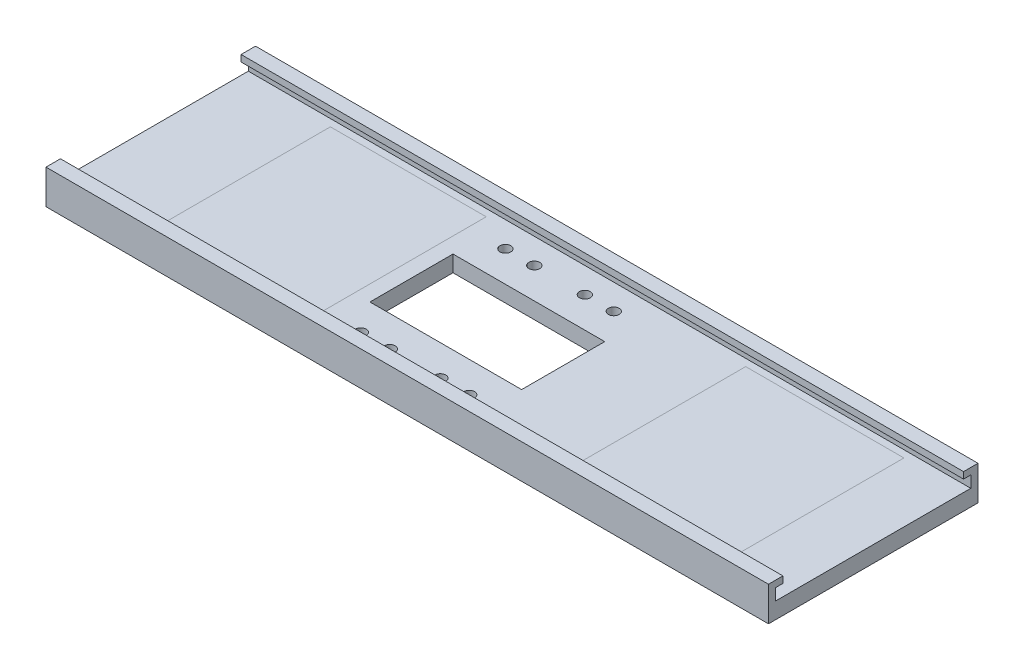
ISO-10303-21;
HEADER;
FILE_DESCRIPTION(('STEP AP214'),'2;1');
FILE_NAME('part.step','',(''),(''),'','','');
FILE_SCHEMA(('AUTOMOTIVE_DESIGN { 1 0 10303 214 1 1 1 1 }'));
ENDSEC;
DATA;
#1=APPLICATION_CONTEXT('core data for automotive mechanical design processes');
#2=APPLICATION_PROTOCOL_DEFINITION('international standard','automotive_design',2000,#1);
#3=PRODUCT_CONTEXT('',#1,'mechanical');
#4=PRODUCT('Part','Part','',(#3));
#5=PRODUCT_RELATED_PRODUCT_CATEGORY('part','',(#4));
#6=PRODUCT_DEFINITION_FORMATION('','',#4);
#7=PRODUCT_DEFINITION_CONTEXT('part definition',#1,'design');
#8=PRODUCT_DEFINITION('design','',#6,#7);
#9=PRODUCT_DEFINITION_SHAPE('','',#8);
#10=(LENGTH_UNIT() NAMED_UNIT(*) SI_UNIT(.MILLI.,.METRE.));
#11=(NAMED_UNIT(*) PLANE_ANGLE_UNIT() SI_UNIT($,.RADIAN.));
#12=(NAMED_UNIT(*) SI_UNIT($,.STERADIAN.) SOLID_ANGLE_UNIT());
#13=UNCERTAINTY_MEASURE_WITH_UNIT(LENGTH_MEASURE(1.E-05),#10,'distance_accuracy_value','');
#14=(GEOMETRIC_REPRESENTATION_CONTEXT(3) GLOBAL_UNCERTAINTY_ASSIGNED_CONTEXT((#13)) GLOBAL_UNIT_ASSIGNED_CONTEXT((#10,
#11,#12)) REPRESENTATION_CONTEXT('',''));
#15=CARTESIAN_POINT('',(0.,0.,0.));
#16=DIRECTION('',(0.,0.,1.));
#17=DIRECTION('',(1.,0.,0.));
#18=AXIS2_PLACEMENT_3D('',#15,#16,#17);
#19=CARTESIAN_POINT('',(-20.,4.5,-25.));
#20=DIRECTION('',(0.,1.,0.));
#21=DIRECTION('',(0.,0.,1.));
#22=AXIS2_PLACEMENT_3D('',#19,#20,#21);
#23=PLANE('',#22);
#24=CARTESIAN_POINT('',(88.17,4.49999999999999,20.));
#25=DIRECTION('',(0.,1.,0.));
#26=DIRECTION('',(0.,0.,-1.));
#27=AXIS2_PLACEMENT_3D('',#24,#25,#26);
#28=CIRCLE('',#27,1.5);
#29=CARTESIAN_POINT('',(88.17,4.49999999999999,18.5));
#30=VERTEX_POINT('',#29);
#31=EDGE_CURVE('E259',#30,#30,#28,.T.);
#32=ORIENTED_EDGE('',*,*,#31,.F.);
#33=EDGE_LOOP('',(#32));
#34=FACE_BOUND('',#33,.T.);
#35=CARTESIAN_POINT('',(58.17,4.5,-20.));
#36=DIRECTION('',(0.,1.,0.));
#37=DIRECTION('',(0.,0.,-1.));
#38=AXIS2_PLACEMENT_3D('',#35,#36,#37);
#39=CIRCLE('',#38,1.5);
#40=CARTESIAN_POINT('',(58.17,4.5,-21.5));
#41=VERTEX_POINT('',#40);
#42=EDGE_CURVE('E309',#41,#41,#39,.T.);
#43=ORIENTED_EDGE('',*,*,#42,.F.);
#44=EDGE_LOOP('',(#43));
#45=FACE_BOUND('',#44,.T.);
#46=CARTESIAN_POINT('',(88.17,4.5,-20.));
#47=DIRECTION('',(0.,1.,0.));
#48=DIRECTION('',(0.,0.,1.));
#49=AXIS2_PLACEMENT_3D('',#46,#47,#48);
#50=CIRCLE('',#49,1.5);
#51=CARTESIAN_POINT('',(88.17,4.5,-18.5));
#52=VERTEX_POINT('',#51);
#53=EDGE_CURVE('E288',#52,#52,#50,.T.);
#54=ORIENTED_EDGE('',*,*,#53,.F.);
#55=EDGE_LOOP('',(#54));
#56=FACE_BOUND('',#55,.T.);
#57=CARTESIAN_POINT('',(80.17,4.5,-20.));
#58=DIRECTION('',(0.,1.,0.));
#59=DIRECTION('',(0.,0.,-1.));
#60=AXIS2_PLACEMENT_3D('',#57,#58,#59);
#61=CIRCLE('',#60,1.5);
#62=CARTESIAN_POINT('',(80.17,4.5,-21.5));
#63=VERTEX_POINT('',#62);
#64=EDGE_CURVE('E278',#63,#63,#61,.T.);
#65=ORIENTED_EDGE('',*,*,#64,.F.);
#66=EDGE_LOOP('',(#65));
#67=FACE_BOUND('',#66,.T.);
#68=CARTESIAN_POINT('',(80.17,4.49999999999999,20.));
#69=DIRECTION('',(0.,1.,0.));
#70=DIRECTION('',(0.,0.,1.));
#71=AXIS2_PLACEMENT_3D('',#68,#69,#70);
#72=CIRCLE('',#71,1.5);
#73=CARTESIAN_POINT('',(80.17,4.49999999999999,21.5));
#74=VERTEX_POINT('',#73);
#75=EDGE_CURVE('E260',#74,#74,#72,.T.);
#76=ORIENTED_EDGE('',*,*,#75,.F.);
#77=EDGE_LOOP('',(#76));
#78=FACE_BOUND('',#77,.T.);
#79=CARTESIAN_POINT('',(66.17,4.49999999999999,20.));
#80=DIRECTION('',(0.,1.,0.));
#81=DIRECTION('',(0.,0.,-1.));
#82=AXIS2_PLACEMENT_3D('',#79,#80,#81);
#83=CIRCLE('',#82,1.5);
#84=CARTESIAN_POINT('',(66.17,4.49999999999999,18.5));
#85=VERTEX_POINT('',#84);
#86=EDGE_CURVE('E347',#85,#85,#83,.T.);
#87=ORIENTED_EDGE('',*,*,#86,.F.);
#88=EDGE_LOOP('',(#87));
#89=FACE_BOUND('',#88,.T.);
#90=CARTESIAN_POINT('',(58.17,4.49999999999999,20.));
#91=DIRECTION('',(0.,1.,0.));
#92=DIRECTION('',(0.,0.,1.));
#93=AXIS2_PLACEMENT_3D('',#90,#91,#92);
#94=CIRCLE('',#93,1.5);
#95=CARTESIAN_POINT('',(58.17,4.49999999999999,21.5));
#96=VERTEX_POINT('',#95);
#97=EDGE_CURVE('E198',#96,#96,#94,.T.);
#98=ORIENTED_EDGE('',*,*,#97,.F.);
#99=EDGE_LOOP('',(#98));
#100=FACE_BOUND('',#99,.T.);
#101=CARTESIAN_POINT('',(66.17,4.5,-20.));
#102=DIRECTION('',(0.,1.,0.));
#103=DIRECTION('',(0.,0.,1.));
#104=AXIS2_PLACEMENT_3D('',#101,#102,#103);
#105=CIRCLE('',#104,1.5);
#106=CARTESIAN_POINT('',(66.17,4.5,-18.5));
#107=VERTEX_POINT('',#106);
#108=EDGE_CURVE('E277',#107,#107,#105,.T.);
#109=ORIENTED_EDGE('',*,*,#108,.F.);
#110=EDGE_LOOP('',(#109));
#111=FACE_BOUND('',#110,.T.);
#112=DIRECTION('',(0.,0.,-1.));
#113=VECTOR('',#112,1.);
#114=CARTESIAN_POINT('',(94.17,4.5,-11.5));
#115=LINE('',#114,#113);
#116=CARTESIAN_POINT('',(94.17,4.49999999999999,11.5));
#117=VERTEX_POINT('',#116);
#118=CARTESIAN_POINT('',(94.17,4.5,-11.5));
#119=VERTEX_POINT('',#118);
#120=EDGE_CURVE('E299',#117,#119,#115,.T.);
#121=ORIENTED_EDGE('',*,*,#120,.F.);
#122=DIRECTION('',(1.,0.,0.));
#123=VECTOR('',#122,1.);
#124=CARTESIAN_POINT('',(52.17,4.49999999999999,11.5));
#125=LINE('',#124,#123);
#126=CARTESIAN_POINT('',(52.17,4.49999999999999,11.5));
#127=VERTEX_POINT('',#126);
#128=EDGE_CURVE('E359',#127,#117,#125,.T.);
#129=ORIENTED_EDGE('',*,*,#128,.F.);
#130=DIRECTION('',(0.,0.,1.));
#131=VECTOR('',#130,1.);
#132=CARTESIAN_POINT('',(52.17,4.5,-11.5));
#133=LINE('',#132,#131);
#134=CARTESIAN_POINT('',(52.17,4.5,-11.5));
#135=VERTEX_POINT('',#134);
#136=EDGE_CURVE('E365',#135,#127,#133,.T.);
#137=ORIENTED_EDGE('',*,*,#136,.F.);
#138=DIRECTION('',(-1.,0.,0.));
#139=VECTOR('',#138,1.);
#140=CARTESIAN_POINT('',(52.17,4.5,-11.5));
#141=LINE('',#140,#139);
#142=EDGE_CURVE('E361',#119,#135,#141,.T.);
#143=ORIENTED_EDGE('',*,*,#142,.F.);
#144=EDGE_LOOP('',(#121,#129,#137,#143));
#145=FACE_BOUND('',#144,.T.);
#146=DIRECTION('',(0.,0.,1.));
#147=VECTOR('',#146,1.);
#148=CARTESIAN_POINT('',(-20.,4.5,-25.));
#149=LINE('',#148,#147);
#150=CARTESIAN_POINT('',(-20.0000000000001,4.49999999999999,-27.));
#151=VERTEX_POINT('',#150);
#152=CARTESIAN_POINT('',(-20.0000000000001,4.49999999999999,27.));
#153=VERTEX_POINT('',#152);
#154=EDGE_CURVE('E178',#151,#153,#149,.T.);
#155=ORIENTED_EDGE('',*,*,#154,.T.);
#156=DIRECTION('',(1.,0.,0.));
#157=VECTOR('',#156,1.);
#158=CARTESIAN_POINT('',(-20.0000000000001,4.49999999999999,27.));
#159=LINE('',#158,#157);
#160=CARTESIAN_POINT('',(180.,4.49999999999999,27.));
#161=VERTEX_POINT('',#160);
#162=EDGE_CURVE('E182',#153,#161,#159,.T.);
#163=ORIENTED_EDGE('',*,*,#162,.T.);
#164=DIRECTION('',(0.,0.,1.));
#165=VECTOR('',#164,1.);
#166=CARTESIAN_POINT('',(180.,4.5,-25.));
#167=LINE('',#166,#165);
#168=CARTESIAN_POINT('',(180.,4.49999999999999,-27.));
#169=VERTEX_POINT('',#168);
#170=EDGE_CURVE('E389',#169,#161,#167,.T.);
#171=ORIENTED_EDGE('',*,*,#170,.F.);
#172=DIRECTION('',(1.,0.,0.));
#173=VECTOR('',#172,1.);
#174=CARTESIAN_POINT('',(-20.0000000000001,4.49999999999999,-27.));
#175=LINE('',#174,#173);
#176=EDGE_CURVE('E184',#151,#169,#175,.T.);
#177=ORIENTED_EDGE('',*,*,#176,.F.);
#178=EDGE_LOOP('',(#155,#163,#171,#177));
#179=FACE_BOUND('',#178,.T.);
#180=DIRECTION('',(-1.,0.,0.));
#181=VECTOR('',#180,1.);
#182=CARTESIAN_POINT('',(-20.,4.49999999999999,25.1527099551687));
#183=LINE('',#182,#181);
#184=CARTESIAN_POINT('',(47.8408458519581,4.49999999999999,25.1527099551687));
#185=VERTEX_POINT('',#184);
#186=CARTESIAN_POINT('',(4.7037729311441,4.49999999999999,25.1527099551687));
#187=VERTEX_POINT('',#186);
#188=EDGE_CURVE('E444',#185,#187,#183,.T.);
#189=ORIENTED_EDGE('',*,*,#188,.T.);
#190=DIRECTION('',(0.,0.,-1.));
#191=VECTOR('',#190,1.);
#192=CARTESIAN_POINT('',(4.7037729311441,4.5,-25.));
#193=LINE('',#192,#191);
#194=CARTESIAN_POINT('',(4.7037729311441,4.5,-25.0184462660137));
#195=VERTEX_POINT('',#194);
#196=EDGE_CURVE('E448',#187,#195,#193,.T.);
#197=ORIENTED_EDGE('',*,*,#196,.T.);
#198=DIRECTION('',(1.,0.,0.));
#199=VECTOR('',#198,1.);
#200=CARTESIAN_POINT('',(-20.,4.5,-25.0184462660137));
#201=LINE('',#200,#199);
#202=CARTESIAN_POINT('',(47.8408458519581,4.5,-25.0184462660137));
#203=VERTEX_POINT('',#202);
#204=EDGE_CURVE('E426',#195,#203,#201,.T.);
#205=ORIENTED_EDGE('',*,*,#204,.T.);
#206=DIRECTION('',(0.,0.,1.));
#207=VECTOR('',#206,1.);
#208=CARTESIAN_POINT('',(47.8408458519581,4.5,-25.));
#209=LINE('',#208,#207);
#210=EDGE_CURVE('E440',#203,#185,#209,.T.);
#211=ORIENTED_EDGE('',*,*,#210,.T.);
#212=EDGE_LOOP('',(#189,#197,#205,#211));
#213=FACE_BOUND('',#212,.T.);
#214=DIRECTION('',(-1.,0.,0.));
#215=VECTOR('',#214,1.);
#216=CARTESIAN_POINT('',(-20.,4.49999999999999,25.1527099551687));
#217=LINE('',#216,#215);
#218=CARTESIAN_POINT('',(163.477577020885,4.49999999999999,25.1527099551687));
#219=VERTEX_POINT('',#218);
#220=CARTESIAN_POINT('',(119.671415411169,4.49999999999999,25.1527099551687));
#221=VERTEX_POINT('',#220);
#222=EDGE_CURVE('E54',#219,#221,#217,.T.);
#223=ORIENTED_EDGE('',*,*,#222,.T.);
#224=DIRECTION('',(0.,0.,-1.));
#225=VECTOR('',#224,1.);
#226=CARTESIAN_POINT('',(119.671415411169,4.5,-25.));
#227=LINE('',#226,#225);
#228=CARTESIAN_POINT('',(119.671415411169,4.5,-25.0184462660137));
#229=VERTEX_POINT('',#228);
#230=EDGE_CURVE('E12',#221,#229,#227,.T.);
#231=ORIENTED_EDGE('',*,*,#230,.T.);
#232=DIRECTION('',(1.,0.,0.));
#233=VECTOR('',#232,1.);
#234=CARTESIAN_POINT('',(-20.,4.5,-25.0184462660137));
#235=LINE('',#234,#233);
#236=CARTESIAN_POINT('',(163.477577020885,4.5,-25.0184462660137));
#237=VERTEX_POINT('',#236);
#238=EDGE_CURVE('E451',#229,#237,#235,.T.);
#239=ORIENTED_EDGE('',*,*,#238,.T.);
#240=DIRECTION('',(0.,0.,1.));
#241=VECTOR('',#240,1.);
#242=CARTESIAN_POINT('',(163.477577020885,4.5,-25.));
#243=LINE('',#242,#241);
#244=EDGE_CURVE('E455',#237,#219,#243,.T.);
#245=ORIENTED_EDGE('',*,*,#244,.T.);
#246=EDGE_LOOP('',(#223,#231,#239,#245));
#247=FACE_BOUND('',#246,.T.);
#248=ADVANCED_FACE('F45',(#34,#45,#56,#67,#78,#89,#100,#111,#145,#179,#213,#247),#23,.T.);
#249=ORIENTED_EDGE('',*,*,#230,.F.);
#250=ORIENTED_EDGE('',*,*,#222,.F.);
#251=ORIENTED_EDGE('',*,*,#244,.F.);
#252=ORIENTED_EDGE('',*,*,#238,.F.);
#253=EDGE_LOOP('',(#249,#250,#251,#252));
#254=FACE_BOUND('',#253,.T.);
#255=ADVANCED_FACE('F332',(#254),#23,.T.);
#256=CARTESIAN_POINT('',(-20.,9.5,-25.));
#257=DIRECTION('',(0.,0.,1.));
#258=DIRECTION('',(1.,0.,0.));
#259=AXIS2_PLACEMENT_3D('',#256,#257,#258);
#260=PLANE('',#259);
#261=DIRECTION('',(1.,0.,0.));
#262=VECTOR('',#261,1.);
#263=CARTESIAN_POINT('',(-45.0000000000001,7.7,-25.));
#264=LINE('',#263,#262);
#265=CARTESIAN_POINT('',(-20.,7.7,-25.));
#266=VERTEX_POINT('',#265);
#267=CARTESIAN_POINT('',(180.,7.7,-25.));
#268=VERTEX_POINT('',#267);
#269=EDGE_CURVE('E246',#266,#268,#264,.T.);
#270=ORIENTED_EDGE('',*,*,#269,.T.);
#271=DIRECTION('',(0.,-1.,0.));
#272=VECTOR('',#271,1.);
#273=CARTESIAN_POINT('',(180.,9.5,-25.));
#274=LINE('',#273,#272);
#275=CARTESIAN_POINT('',(180.,9.5,-25.));
#276=VERTEX_POINT('',#275);
#277=EDGE_CURVE('E386',#276,#268,#274,.T.);
#278=ORIENTED_EDGE('',*,*,#277,.F.);
#279=DIRECTION('',(1.,0.,0.));
#280=VECTOR('',#279,1.);
#281=CARTESIAN_POINT('',(-20.,9.5,-25.));
#282=LINE('',#281,#280);
#283=CARTESIAN_POINT('',(-20.,9.5,-25.));
#284=VERTEX_POINT('',#283);
#285=EDGE_CURVE('E423',#284,#276,#282,.T.);
#286=ORIENTED_EDGE('',*,*,#285,.F.);
#287=DIRECTION('',(0.,-1.,0.));
#288=VECTOR('',#287,1.);
#289=CARTESIAN_POINT('',(-20.,9.5,-25.));
#290=LINE('',#289,#288);
#291=EDGE_CURVE('E189',#284,#266,#290,.T.);
#292=ORIENTED_EDGE('',*,*,#291,.T.);
#293=EDGE_LOOP('',(#270,#278,#286,#292));
#294=FACE_BOUND('',#293,.T.);
#295=ADVANCED_FACE('F462',(#294),#260,.T.);
#296=CARTESIAN_POINT('',(-20.,9.5,-29.));
#297=DIRECTION('',(0.,1.,0.));
#298=DIRECTION('',(0.,0.,1.));
#299=AXIS2_PLACEMENT_3D('',#296,#297,#298);
#300=PLANE('',#299);
#301=ORIENTED_EDGE('',*,*,#285,.T.);
#302=DIRECTION('',(0.,0.,1.));
#303=VECTOR('',#302,1.);
#304=CARTESIAN_POINT('',(180.,9.5,-29.));
#305=LINE('',#304,#303);
#306=CARTESIAN_POINT('',(180.,9.5,-29.));
#307=VERTEX_POINT('',#306);
#308=EDGE_CURVE('E377',#307,#276,#305,.T.);
#309=ORIENTED_EDGE('',*,*,#308,.F.);
#310=DIRECTION('',(1.,0.,0.));
#311=VECTOR('',#310,1.);
#312=CARTESIAN_POINT('',(-20.,9.5,-29.));
#313=LINE('',#312,#311);
#314=CARTESIAN_POINT('',(-20.,9.5,-29.));
#315=VERTEX_POINT('',#314);
#316=EDGE_CURVE('E424',#315,#307,#313,.T.);
#317=ORIENTED_EDGE('',*,*,#316,.F.);
#318=DIRECTION('',(0.,0.,1.));
#319=VECTOR('',#318,1.);
#320=CARTESIAN_POINT('',(-20.,9.5,-29.));
#321=LINE('',#320,#319);
#322=EDGE_CURVE('E405',#315,#284,#321,.T.);
#323=ORIENTED_EDGE('',*,*,#322,.T.);
#324=EDGE_LOOP('',(#301,#309,#317,#323));
#325=FACE_BOUND('',#324,.T.);
#326=ADVANCED_FACE('F47',(#325),#300,.T.);
#327=CARTESIAN_POINT('',(-20.,0.,-29.));
#328=DIRECTION('',(0.,0.,-1.));
#329=DIRECTION('',(-1.,0.,0.));
#330=AXIS2_PLACEMENT_3D('',#327,#328,#329);
#331=PLANE('',#330);
#332=ORIENTED_EDGE('',*,*,#316,.T.);
#333=DIRECTION('',(0.,1.,0.));
#334=VECTOR('',#333,1.);
#335=CARTESIAN_POINT('',(180.,0.,-29.));
#336=LINE('',#335,#334);
#337=CARTESIAN_POINT('',(180.,0.,-29.));
#338=VERTEX_POINT('',#337);
#339=EDGE_CURVE('E402',#338,#307,#336,.T.);
#340=ORIENTED_EDGE('',*,*,#339,.F.);
#341=DIRECTION('',(1.,0.,0.));
#342=VECTOR('',#341,1.);
#343=CARTESIAN_POINT('',(-20.,0.,-29.));
#344=LINE('',#343,#342);
#345=CARTESIAN_POINT('',(-20.,0.,-29.));
#346=VERTEX_POINT('',#345);
#347=EDGE_CURVE('E427',#346,#338,#344,.T.);
#348=ORIENTED_EDGE('',*,*,#347,.F.);
#349=DIRECTION('',(0.,1.,0.));
#350=VECTOR('',#349,1.);
#351=CARTESIAN_POINT('',(-20.,0.,-29.));
#352=LINE('',#351,#350);
#353=EDGE_CURVE('E420',#346,#315,#352,.T.);
#354=ORIENTED_EDGE('',*,*,#353,.T.);
#355=EDGE_LOOP('',(#332,#340,#348,#354));
#356=FACE_BOUND('',#355,.T.);
#357=ADVANCED_FACE('F493',(#356),#331,.T.);
#358=CARTESIAN_POINT('',(-20.,0.,29.));
#359=DIRECTION('',(0.,-1.,0.));
#360=DIRECTION('',(0.,0.,-1.));
#361=AXIS2_PLACEMENT_3D('',#358,#359,#360);
#362=PLANE('',#361);
#363=CARTESIAN_POINT('',(97.93,0.,5.));
#364=DIRECTION('',(0.,-1.,0.));
#365=DIRECTION('',(0.,0.,1.));
#366=AXIS2_PLACEMENT_3D('',#363,#364,#365);
#367=CIRCLE('',#366,3.00000000000001);
#368=CARTESIAN_POINT('',(97.93,0.,8.00000000000001));
#369=VERTEX_POINT('',#368);
#370=EDGE_CURVE('E204',#369,#369,#367,.T.);
#371=ORIENTED_EDGE('',*,*,#370,.F.);
#372=EDGE_LOOP('',(#371));
#373=FACE_BOUND('',#372,.T.);
#374=CARTESIAN_POINT('',(48.41,0.,5.00000000000001));
#375=DIRECTION('',(0.,-1.,0.));
#376=DIRECTION('',(0.,0.,-1.));
#377=AXIS2_PLACEMENT_3D('',#374,#375,#376);
#378=CIRCLE('',#377,3.00000000000001);
#379=CARTESIAN_POINT('',(48.41,0.,2.));
#380=VERTEX_POINT('',#379);
#381=EDGE_CURVE('E221',#380,#380,#378,.T.);
#382=ORIENTED_EDGE('',*,*,#381,.F.);
#383=EDGE_LOOP('',(#382));
#384=FACE_BOUND('',#383,.T.);
#385=CARTESIAN_POINT('',(48.41,0.,-5.));
#386=DIRECTION('',(0.,-1.,0.));
#387=DIRECTION('',(0.,0.,1.));
#388=AXIS2_PLACEMENT_3D('',#385,#386,#387);
#389=CIRCLE('',#388,3.00000000000001);
#390=CARTESIAN_POINT('',(48.41,0.,-1.99999999999999));
#391=VERTEX_POINT('',#390);
#392=EDGE_CURVE('E215',#391,#391,#389,.T.);
#393=ORIENTED_EDGE('',*,*,#392,.F.);
#394=EDGE_LOOP('',(#393));
#395=FACE_BOUND('',#394,.T.);
#396=CARTESIAN_POINT('',(97.93,0.,-5.));
#397=DIRECTION('',(0.,-1.,0.));
#398=DIRECTION('',(0.,0.,-1.));
#399=AXIS2_PLACEMENT_3D('',#396,#397,#398);
#400=CIRCLE('',#399,3.00000000000001);
#401=CARTESIAN_POINT('',(97.93,0.,-8.00000000000001));
#402=VERTEX_POINT('',#401);
#403=EDGE_CURVE('E214',#402,#402,#400,.T.);
#404=ORIENTED_EDGE('',*,*,#403,.F.);
#405=EDGE_LOOP('',(#404));
#406=FACE_BOUND('',#405,.T.);
#407=CARTESIAN_POINT('',(88.17,0.,20.));
#408=DIRECTION('',(0.,1.,0.));
#409=DIRECTION('',(0.,0.,-1.));
#410=AXIS2_PLACEMENT_3D('',#407,#408,#409);
#411=CIRCLE('',#410,1.5);
#412=CARTESIAN_POINT('',(88.17,0.,18.5));
#413=VERTEX_POINT('',#412);
#414=EDGE_CURVE('E270',#413,#413,#411,.T.);
#415=ORIENTED_EDGE('',*,*,#414,.T.);
#416=EDGE_LOOP('',(#415));
#417=FACE_BOUND('',#416,.T.);
#418=CARTESIAN_POINT('',(58.17,0.,-20.));
#419=DIRECTION('',(0.,1.,0.));
#420=DIRECTION('',(0.,0.,-1.));
#421=AXIS2_PLACEMENT_3D('',#418,#419,#420);
#422=CIRCLE('',#421,1.5);
#423=CARTESIAN_POINT('',(58.17,0.,-21.5));
#424=VERTEX_POINT('',#423);
#425=EDGE_CURVE('E293',#424,#424,#422,.T.);
#426=ORIENTED_EDGE('',*,*,#425,.T.);
#427=EDGE_LOOP('',(#426));
#428=FACE_BOUND('',#427,.T.);
#429=CARTESIAN_POINT('',(88.17,0.,-20.));
#430=DIRECTION('',(0.,1.,0.));
#431=DIRECTION('',(0.,0.,1.));
#432=AXIS2_PLACEMENT_3D('',#429,#430,#431);
#433=CIRCLE('',#432,1.5);
#434=CARTESIAN_POINT('',(88.17,0.,-18.5));
#435=VERTEX_POINT('',#434);
#436=EDGE_CURVE('E292',#435,#435,#433,.T.);
#437=ORIENTED_EDGE('',*,*,#436,.T.);
#438=EDGE_LOOP('',(#437));
#439=FACE_BOUND('',#438,.T.);
#440=CARTESIAN_POINT('',(80.17,0.,-20.));
#441=DIRECTION('',(0.,1.,0.));
#442=DIRECTION('',(0.,0.,-1.));
#443=AXIS2_PLACEMENT_3D('',#440,#441,#442);
#444=CIRCLE('',#443,1.5);
#445=CARTESIAN_POINT('',(80.17,0.,-21.5));
#446=VERTEX_POINT('',#445);
#447=EDGE_CURVE('E273',#446,#446,#444,.T.);
#448=ORIENTED_EDGE('',*,*,#447,.T.);
#449=EDGE_LOOP('',(#448));
#450=FACE_BOUND('',#449,.T.);
#451=CARTESIAN_POINT('',(80.17,0.,20.));
#452=DIRECTION('',(0.,1.,0.));
#453=DIRECTION('',(0.,0.,1.));
#454=AXIS2_PLACEMENT_3D('',#451,#452,#453);
#455=CIRCLE('',#454,1.5);
#456=CARTESIAN_POINT('',(80.17,0.,21.5));
#457=VERTEX_POINT('',#456);
#458=EDGE_CURVE('E255',#457,#457,#455,.T.);
#459=ORIENTED_EDGE('',*,*,#458,.T.);
#460=EDGE_LOOP('',(#459));
#461=FACE_BOUND('',#460,.T.);
#462=CARTESIAN_POINT('',(66.17,0.,20.));
#463=DIRECTION('',(0.,1.,0.));
#464=DIRECTION('',(0.,0.,-1.));
#465=AXIS2_PLACEMENT_3D('',#462,#463,#464);
#466=CIRCLE('',#465,1.5);
#467=CARTESIAN_POINT('',(66.17,0.,18.5));
#468=VERTEX_POINT('',#467);
#469=EDGE_CURVE('E847',#468,#468,#466,.T.);
#470=ORIENTED_EDGE('',*,*,#469,.T.);
#471=EDGE_LOOP('',(#470));
#472=FACE_BOUND('',#471,.T.);
#473=CARTESIAN_POINT('',(58.17,0.,20.));
#474=DIRECTION('',(0.,1.,0.));
#475=DIRECTION('',(0.,0.,1.));
#476=AXIS2_PLACEMENT_3D('',#473,#474,#475);
#477=CIRCLE('',#476,1.5);
#478=CARTESIAN_POINT('',(58.17,0.,21.5));
#479=VERTEX_POINT('',#478);
#480=EDGE_CURVE('E851',#479,#479,#477,.T.);
#481=ORIENTED_EDGE('',*,*,#480,.T.);
#482=EDGE_LOOP('',(#481));
#483=FACE_BOUND('',#482,.T.);
#484=CARTESIAN_POINT('',(66.17,0.,-20.));
#485=DIRECTION('',(0.,1.,0.));
#486=DIRECTION('',(0.,0.,1.));
#487=AXIS2_PLACEMENT_3D('',#484,#485,#486);
#488=CIRCLE('',#487,1.5);
#489=CARTESIAN_POINT('',(66.17,0.,-18.5));
#490=VERTEX_POINT('',#489);
#491=EDGE_CURVE('E295',#490,#490,#488,.T.);
#492=ORIENTED_EDGE('',*,*,#491,.T.);
#493=EDGE_LOOP('',(#492));
#494=FACE_BOUND('',#493,.T.);
#495=DIRECTION('',(0.,0.,-1.));
#496=VECTOR('',#495,1.);
#497=CARTESIAN_POINT('',(94.17,0.,-11.5));
#498=LINE('',#497,#496);
#499=CARTESIAN_POINT('',(94.17,0.,11.5));
#500=VERTEX_POINT('',#499);
#501=CARTESIAN_POINT('',(94.17,0.,-11.5));
#502=VERTEX_POINT('',#501);
#503=EDGE_CURVE('E374',#500,#502,#498,.T.);
#504=ORIENTED_EDGE('',*,*,#503,.T.);
#505=DIRECTION('',(-1.,0.,0.));
#506=VECTOR('',#505,1.);
#507=CARTESIAN_POINT('',(52.17,0.,-11.5));
#508=LINE('',#507,#506);
#509=CARTESIAN_POINT('',(52.17,0.,-11.5));
#510=VERTEX_POINT('',#509);
#511=EDGE_CURVE('E871',#502,#510,#508,.T.);
#512=ORIENTED_EDGE('',*,*,#511,.T.);
#513=DIRECTION('',(0.,0.,1.));
#514=VECTOR('',#513,1.);
#515=CARTESIAN_POINT('',(52.17,0.,-11.5));
#516=LINE('',#515,#514);
#517=CARTESIAN_POINT('',(52.17,0.,11.5));
#518=VERTEX_POINT('',#517);
#519=EDGE_CURVE('E873',#510,#518,#516,.T.);
#520=ORIENTED_EDGE('',*,*,#519,.T.);
#521=DIRECTION('',(1.,0.,0.));
#522=VECTOR('',#521,1.);
#523=CARTESIAN_POINT('',(52.17,0.,11.5));
#524=LINE('',#523,#522);
#525=EDGE_CURVE('E368',#518,#500,#524,.T.);
#526=ORIENTED_EDGE('',*,*,#525,.T.);
#527=EDGE_LOOP('',(#504,#512,#520,#526));
#528=FACE_BOUND('',#527,.T.);
#529=ORIENTED_EDGE('',*,*,#347,.T.);
#530=DIRECTION('',(0.,0.,-1.));
#531=VECTOR('',#530,1.);
#532=CARTESIAN_POINT('',(180.,0.,29.));
#533=LINE('',#532,#531);
#534=CARTESIAN_POINT('',(180.,0.,29.));
#535=VERTEX_POINT('',#534);
#536=EDGE_CURVE('E399',#535,#338,#533,.T.);
#537=ORIENTED_EDGE('',*,*,#536,.F.);
#538=DIRECTION('',(1.,0.,0.));
#539=VECTOR('',#538,1.);
#540=CARTESIAN_POINT('',(-20.,0.,29.));
#541=LINE('',#540,#539);
#542=CARTESIAN_POINT('',(-20.,0.,29.));
#543=VERTEX_POINT('',#542);
#544=EDGE_CURVE('E429',#543,#535,#541,.T.);
#545=ORIENTED_EDGE('',*,*,#544,.F.);
#546=DIRECTION('',(0.,0.,-1.));
#547=VECTOR('',#546,1.);
#548=CARTESIAN_POINT('',(-20.,0.,29.));
#549=LINE('',#548,#547);
#550=EDGE_CURVE('E417',#543,#346,#549,.T.);
#551=ORIENTED_EDGE('',*,*,#550,.T.);
#552=EDGE_LOOP('',(#529,#537,#545,#551));
#553=FACE_BOUND('',#552,.T.);
#554=ADVANCED_FACE('F319',(#373,#384,#395,#406,#417,#428,#439,#450,#461,#472,#483,#494,#528,
#553),#362,.T.);
#555=CARTESIAN_POINT('',(-20.,0.,29.));
#556=DIRECTION('',(0.,0.,1.));
#557=DIRECTION('',(1.,0.,0.));
#558=AXIS2_PLACEMENT_3D('',#555,#556,#557);
#559=PLANE('',#558);
#560=ORIENTED_EDGE('',*,*,#544,.T.);
#561=DIRECTION('',(0.,-1.,0.));
#562=VECTOR('',#561,1.);
#563=CARTESIAN_POINT('',(180.,0.,29.));
#564=LINE('',#563,#562);
#565=CARTESIAN_POINT('',(180.,9.49999999999999,29.));
#566=VERTEX_POINT('',#565);
#567=EDGE_CURVE('E396',#566,#535,#564,.T.);
#568=ORIENTED_EDGE('',*,*,#567,.F.);
#569=DIRECTION('',(1.,0.,0.));
#570=VECTOR('',#569,1.);
#571=CARTESIAN_POINT('',(-20.,9.49999999999999,29.));
#572=LINE('',#571,#570);
#573=CARTESIAN_POINT('',(-20.,9.49999999999999,29.));
#574=VERTEX_POINT('',#573);
#575=EDGE_CURVE('E431',#574,#566,#572,.T.);
#576=ORIENTED_EDGE('',*,*,#575,.F.);
#577=DIRECTION('',(0.,-1.,0.));
#578=VECTOR('',#577,1.);
#579=CARTESIAN_POINT('',(-20.,0.,29.));
#580=LINE('',#579,#578);
#581=EDGE_CURVE('E414',#574,#543,#580,.T.);
#582=ORIENTED_EDGE('',*,*,#581,.T.);
#583=EDGE_LOOP('',(#560,#568,#576,#582));
#584=FACE_BOUND('',#583,.T.);
#585=ADVANCED_FACE('F483',(#584),#559,.T.);
#586=CARTESIAN_POINT('',(-20.,9.49999999999999,29.));
#587=DIRECTION('',(0.,1.,0.));
#588=DIRECTION('',(0.,0.,1.));
#589=AXIS2_PLACEMENT_3D('',#586,#587,#588);
#590=PLANE('',#589);
#591=ORIENTED_EDGE('',*,*,#575,.T.);
#592=DIRECTION('',(0.,0.,1.));
#593=VECTOR('',#592,1.);
#594=CARTESIAN_POINT('',(180.,9.49999999999999,29.));
#595=LINE('',#594,#593);
#596=CARTESIAN_POINT('',(180.,9.49999999999999,25.));
#597=VERTEX_POINT('',#596);
#598=EDGE_CURVE('E393',#597,#566,#595,.T.);
#599=ORIENTED_EDGE('',*,*,#598,.F.);
#600=DIRECTION('',(1.,0.,0.));
#601=VECTOR('',#600,1.);
#602=CARTESIAN_POINT('',(-20.,9.49999999999999,25.));
#603=LINE('',#602,#601);
#604=CARTESIAN_POINT('',(-20.,9.49999999999999,25.));
#605=VERTEX_POINT('',#604);
#606=EDGE_CURVE('E433',#605,#597,#603,.T.);
#607=ORIENTED_EDGE('',*,*,#606,.F.);
#608=DIRECTION('',(0.,0.,1.));
#609=VECTOR('',#608,1.);
#610=CARTESIAN_POINT('',(-20.,9.49999999999999,29.));
#611=LINE('',#610,#609);
#612=EDGE_CURVE('E411',#605,#574,#611,.T.);
#613=ORIENTED_EDGE('',*,*,#612,.T.);
#614=EDGE_LOOP('',(#591,#599,#607,#613));
#615=FACE_BOUND('',#614,.T.);
#616=ADVANCED_FACE('F477',(#615),#590,.T.);
#617=CARTESIAN_POINT('',(-20.,9.49999999999999,25.));
#618=DIRECTION('',(0.,0.,-1.));
#619=DIRECTION('',(-1.,0.,0.));
#620=AXIS2_PLACEMENT_3D('',#617,#618,#619);
#621=PLANE('',#620);
#622=DIRECTION('',(1.,0.,0.));
#623=VECTOR('',#622,1.);
#624=CARTESIAN_POINT('',(-45.0000000000001,7.69999999999999,25.));
#625=LINE('',#624,#623);
#626=CARTESIAN_POINT('',(-20.,7.69999999999999,25.));
#627=VERTEX_POINT('',#626);
#628=CARTESIAN_POINT('',(180.,7.69999999999999,25.));
#629=VERTEX_POINT('',#628);
#630=EDGE_CURVE('E237',#627,#629,#625,.T.);
#631=ORIENTED_EDGE('',*,*,#630,.F.);
#632=DIRECTION('',(0.,1.,0.));
#633=VECTOR('',#632,1.);
#634=CARTESIAN_POINT('',(-20.,9.49999999999999,25.));
#635=LINE('',#634,#633);
#636=EDGE_CURVE('E188',#627,#605,#635,.T.);
#637=ORIENTED_EDGE('',*,*,#636,.T.);
#638=ORIENTED_EDGE('',*,*,#606,.T.);
#639=DIRECTION('',(0.,1.,0.));
#640=VECTOR('',#639,1.);
#641=CARTESIAN_POINT('',(180.,9.49999999999999,25.));
#642=LINE('',#641,#640);
#643=EDGE_CURVE('E391',#629,#597,#642,.T.);
#644=ORIENTED_EDGE('',*,*,#643,.F.);
#645=EDGE_LOOP('',(#631,#637,#638,#644));
#646=FACE_BOUND('',#645,.T.);
#647=ADVANCED_FACE('F469',(#646),#621,.T.);
#648=ORIENTED_EDGE('',*,*,#196,.F.);
#649=ORIENTED_EDGE('',*,*,#188,.F.);
#650=ORIENTED_EDGE('',*,*,#210,.F.);
#651=ORIENTED_EDGE('',*,*,#204,.F.);
#652=EDGE_LOOP('',(#648,#649,#650,#651));
#653=FACE_BOUND('',#652,.T.);
#654=ADVANCED_FACE('F334',(#653),#23,.T.);
#655=CARTESIAN_POINT('',(-20.,0.,0.));
#656=DIRECTION('',(1.,0.,0.));
#657=DIRECTION('',(0.,0.,-1.));
#658=AXIS2_PLACEMENT_3D('',#655,#656,#657);
#659=PLANE('',#658);
#660=DIRECTION('',(0.,-1.,0.));
#661=VECTOR('',#660,1.);
#662=CARTESIAN_POINT('',(-20.,0.,27.));
#663=LINE('',#662,#661);
#664=CARTESIAN_POINT('',(-20.,7.69999999999999,27.));
#665=VERTEX_POINT('',#664);
#666=EDGE_CURVE('E192',#665,#153,#663,.T.);
#667=ORIENTED_EDGE('',*,*,#666,.T.);
#668=ORIENTED_EDGE('',*,*,#154,.F.);
#669=DIRECTION('',(0.,1.,0.));
#670=VECTOR('',#669,1.);
#671=CARTESIAN_POINT('',(-20.,0.,-27.));
#672=LINE('',#671,#670);
#673=CARTESIAN_POINT('',(-20.,7.7,-27.));
#674=VERTEX_POINT('',#673);
#675=EDGE_CURVE('E240',#151,#674,#672,.T.);
#676=ORIENTED_EDGE('',*,*,#675,.T.);
#677=DIRECTION('',(0.,0.,1.));
#678=VECTOR('',#677,1.);
#679=CARTESIAN_POINT('',(-20.,7.69999999999999,0.));
#680=LINE('',#679,#678);
#681=EDGE_CURVE('E251',#674,#266,#680,.T.);
#682=ORIENTED_EDGE('',*,*,#681,.T.);
#683=ORIENTED_EDGE('',*,*,#291,.F.);
#684=ORIENTED_EDGE('',*,*,#322,.F.);
#685=ORIENTED_EDGE('',*,*,#353,.F.);
#686=ORIENTED_EDGE('',*,*,#550,.F.);
#687=ORIENTED_EDGE('',*,*,#581,.F.);
#688=ORIENTED_EDGE('',*,*,#612,.F.);
#689=ORIENTED_EDGE('',*,*,#636,.F.);
#690=DIRECTION('',(0.,0.,1.));
#691=VECTOR('',#690,1.);
#692=CARTESIAN_POINT('',(-20.,7.69999999999999,0.));
#693=LINE('',#692,#691);
#694=EDGE_CURVE('E195',#627,#665,#693,.T.);
#695=ORIENTED_EDGE('',*,*,#694,.T.);
#696=EDGE_LOOP('',(#667,#668,#676,#682,#683,#684,#685,#686,#687,#688,#689,#695));
#697=FACE_BOUND('',#696,.T.);
#698=ADVANCED_FACE('F193',(#697),#659,.F.);
#699=CARTESIAN_POINT('',(180.,0.,0.));
#700=DIRECTION('',(1.,0.,0.));
#701=DIRECTION('',(0.,0.,-1.));
#702=AXIS2_PLACEMENT_3D('',#699,#700,#701);
#703=PLANE('',#702);
#704=ORIENTED_EDGE('',*,*,#170,.T.);
#705=DIRECTION('',(0.,-1.,0.));
#706=VECTOR('',#705,1.);
#707=CARTESIAN_POINT('',(180.,7.69999999999999,27.));
#708=LINE('',#707,#706);
#709=CARTESIAN_POINT('',(180.,7.69999999999999,27.));
#710=VERTEX_POINT('',#709);
#711=EDGE_CURVE('E203',#710,#161,#708,.T.);
#712=ORIENTED_EDGE('',*,*,#711,.F.);
#713=DIRECTION('',(0.,0.,1.));
#714=VECTOR('',#713,1.);
#715=CARTESIAN_POINT('',(180.,7.69999999999999,25.));
#716=LINE('',#715,#714);
#717=EDGE_CURVE('E232',#629,#710,#716,.T.);
#718=ORIENTED_EDGE('',*,*,#717,.F.);
#719=ORIENTED_EDGE('',*,*,#643,.T.);
#720=ORIENTED_EDGE('',*,*,#598,.T.);
#721=ORIENTED_EDGE('',*,*,#567,.T.);
#722=ORIENTED_EDGE('',*,*,#536,.T.);
#723=ORIENTED_EDGE('',*,*,#339,.T.);
#724=ORIENTED_EDGE('',*,*,#308,.T.);
#725=ORIENTED_EDGE('',*,*,#277,.T.);
#726=DIRECTION('',(0.,0.,1.));
#727=VECTOR('',#726,1.);
#728=CARTESIAN_POINT('',(180.,7.7,-25.));
#729=LINE('',#728,#727);
#730=CARTESIAN_POINT('',(180.,7.7,-27.));
#731=VERTEX_POINT('',#730);
#732=EDGE_CURVE('E229',#731,#268,#729,.T.);
#733=ORIENTED_EDGE('',*,*,#732,.F.);
#734=DIRECTION('',(0.,1.,0.));
#735=VECTOR('',#734,1.);
#736=CARTESIAN_POINT('',(180.,7.7,-27.));
#737=LINE('',#736,#735);
#738=EDGE_CURVE('E243',#169,#731,#737,.T.);
#739=ORIENTED_EDGE('',*,*,#738,.F.);
#740=EDGE_LOOP('',(#704,#712,#718,#719,#720,#721,#722,#723,#724,#725,#733,#739));
#741=FACE_BOUND('',#740,.T.);
#742=ADVANCED_FACE('F475',(#741),#703,.T.);
#743=CARTESIAN_POINT('',(94.17,0.,-11.5));
#744=DIRECTION('',(1.,0.,0.));
#745=DIRECTION('',(0.,0.,-1.));
#746=AXIS2_PLACEMENT_3D('',#743,#744,#745);
#747=PLANE('',#746);
#748=ORIENTED_EDGE('',*,*,#120,.T.);
#749=DIRECTION('',(0.,1.,0.));
#750=VECTOR('',#749,1.);
#751=CARTESIAN_POINT('',(94.17,0.,-11.5));
#752=LINE('',#751,#750);
#753=EDGE_CURVE('E382',#502,#119,#752,.T.);
#754=ORIENTED_EDGE('',*,*,#753,.F.);
#755=ORIENTED_EDGE('',*,*,#503,.F.);
#756=DIRECTION('',(0.,1.,0.));
#757=VECTOR('',#756,1.);
#758=CARTESIAN_POINT('',(94.17,0.,11.5));
#759=LINE('',#758,#757);
#760=EDGE_CURVE('E375',#500,#117,#759,.T.);
#761=ORIENTED_EDGE('',*,*,#760,.T.);
#762=EDGE_LOOP('',(#748,#754,#755,#761));
#763=FACE_BOUND('',#762,.T.);
#764=ADVANCED_FACE('F500',(#763),#747,.F.);
#765=CARTESIAN_POINT('',(52.17,0.,11.5));
#766=DIRECTION('',(0.,0.,1.));
#767=DIRECTION('',(0.,-1.,0.));
#768=AXIS2_PLACEMENT_3D('',#765,#766,#767);
#769=PLANE('',#768);
#770=ORIENTED_EDGE('',*,*,#128,.T.);
#771=ORIENTED_EDGE('',*,*,#760,.F.);
#772=ORIENTED_EDGE('',*,*,#525,.F.);
#773=DIRECTION('',(0.,1.,0.));
#774=VECTOR('',#773,1.);
#775=CARTESIAN_POINT('',(52.17,0.,11.5));
#776=LINE('',#775,#774);
#777=EDGE_CURVE('E378',#518,#127,#776,.T.);
#778=ORIENTED_EDGE('',*,*,#777,.T.);
#779=EDGE_LOOP('',(#770,#771,#772,#778));
#780=FACE_BOUND('',#779,.T.);
#781=ADVANCED_FACE('F504',(#780),#769,.F.);
#782=CARTESIAN_POINT('',(52.17,0.,-11.5));
#783=DIRECTION('',(-1.,0.,0.));
#784=DIRECTION('',(0.,0.,1.));
#785=AXIS2_PLACEMENT_3D('',#782,#783,#784);
#786=PLANE('',#785);
#787=ORIENTED_EDGE('',*,*,#136,.T.);
#788=ORIENTED_EDGE('',*,*,#777,.F.);
#789=ORIENTED_EDGE('',*,*,#519,.F.);
#790=DIRECTION('',(0.,1.,0.));
#791=VECTOR('',#790,1.);
#792=CARTESIAN_POINT('',(52.17,0.,-11.5));
#793=LINE('',#792,#791);
#794=EDGE_CURVE('E380',#510,#135,#793,.T.);
#795=ORIENTED_EDGE('',*,*,#794,.T.);
#796=EDGE_LOOP('',(#787,#788,#789,#795));
#797=FACE_BOUND('',#796,.T.);
#798=ADVANCED_FACE('F509',(#797),#786,.F.);
#799=CARTESIAN_POINT('',(52.17,0.,-11.5));
#800=DIRECTION('',(0.,0.,-1.));
#801=DIRECTION('',(0.,1.,0.));
#802=AXIS2_PLACEMENT_3D('',#799,#800,#801);
#803=PLANE('',#802);
#804=ORIENTED_EDGE('',*,*,#142,.T.);
#805=ORIENTED_EDGE('',*,*,#794,.F.);
#806=ORIENTED_EDGE('',*,*,#511,.F.);
#807=ORIENTED_EDGE('',*,*,#753,.T.);
#808=EDGE_LOOP('',(#804,#805,#806,#807));
#809=FACE_BOUND('',#808,.T.);
#810=ADVANCED_FACE('F505',(#809),#803,.F.);
#811=CARTESIAN_POINT('',(66.17,0.,-20.));
#812=DIRECTION('',(0.,1.,0.));
#813=DIRECTION('',(0.,0.,1.));
#814=AXIS2_PLACEMENT_3D('',#811,#812,#813);
#815=CYLINDRICAL_SURFACE('',#814,1.5);
#816=ORIENTED_EDGE('',*,*,#491,.F.);
#817=EDGE_LOOP('',(#816));
#818=FACE_BOUND('',#817,.T.);
#819=ORIENTED_EDGE('',*,*,#108,.T.);
#820=EDGE_LOOP('',(#819));
#821=FACE_BOUND('',#820,.T.);
#822=ADVANCED_FACE('F508',(#818,#821),#815,.F.);
#823=CARTESIAN_POINT('',(58.17,0.,20.));
#824=DIRECTION('',(0.,1.,0.));
#825=DIRECTION('',(0.,0.,1.));
#826=AXIS2_PLACEMENT_3D('',#823,#824,#825);
#827=CYLINDRICAL_SURFACE('',#826,1.5);
#828=ORIENTED_EDGE('',*,*,#480,.F.);
#829=EDGE_LOOP('',(#828));
#830=FACE_BOUND('',#829,.T.);
#831=ORIENTED_EDGE('',*,*,#97,.T.);
#832=EDGE_LOOP('',(#831));
#833=FACE_BOUND('',#832,.T.);
#834=ADVANCED_FACE('F519',(#830,#833),#827,.F.);
#835=CARTESIAN_POINT('',(66.17,0.,20.));
#836=DIRECTION('',(0.,1.,0.));
#837=DIRECTION('',(0.,0.,1.));
#838=AXIS2_PLACEMENT_3D('',#835,#836,#837);
#839=CYLINDRICAL_SURFACE('',#838,1.5);
#840=ORIENTED_EDGE('',*,*,#469,.F.);
#841=EDGE_LOOP('',(#840));
#842=FACE_BOUND('',#841,.T.);
#843=ORIENTED_EDGE('',*,*,#86,.T.);
#844=EDGE_LOOP('',(#843));
#845=FACE_BOUND('',#844,.T.);
#846=ADVANCED_FACE('F535',(#842,#845),#839,.F.);
#847=CARTESIAN_POINT('',(80.17,0.,20.));
#848=DIRECTION('',(0.,1.,0.));
#849=DIRECTION('',(0.,0.,1.));
#850=AXIS2_PLACEMENT_3D('',#847,#848,#849);
#851=CYLINDRICAL_SURFACE('',#850,1.5);
#852=ORIENTED_EDGE('',*,*,#458,.F.);
#853=EDGE_LOOP('',(#852));
#854=FACE_BOUND('',#853,.T.);
#855=ORIENTED_EDGE('',*,*,#75,.T.);
#856=EDGE_LOOP('',(#855));
#857=FACE_BOUND('',#856,.T.);
#858=ADVANCED_FACE('F527',(#854,#857),#851,.F.);
#859=CARTESIAN_POINT('',(80.17,0.,-20.));
#860=DIRECTION('',(0.,1.,0.));
#861=DIRECTION('',(0.,0.,1.));
#862=AXIS2_PLACEMENT_3D('',#859,#860,#861);
#863=CYLINDRICAL_SURFACE('',#862,1.5);
#864=ORIENTED_EDGE('',*,*,#447,.F.);
#865=EDGE_LOOP('',(#864));
#866=FACE_BOUND('',#865,.T.);
#867=ORIENTED_EDGE('',*,*,#64,.T.);
#868=EDGE_LOOP('',(#867));
#869=FACE_BOUND('',#868,.T.);
#870=ADVANCED_FACE('F524',(#866,#869),#863,.F.);
#871=CARTESIAN_POINT('',(88.17,0.,-20.));
#872=DIRECTION('',(0.,1.,0.));
#873=DIRECTION('',(0.,0.,1.));
#874=AXIS2_PLACEMENT_3D('',#871,#872,#873);
#875=CYLINDRICAL_SURFACE('',#874,1.5);
#876=ORIENTED_EDGE('',*,*,#436,.F.);
#877=EDGE_LOOP('',(#876));
#878=FACE_BOUND('',#877,.T.);
#879=ORIENTED_EDGE('',*,*,#53,.T.);
#880=EDGE_LOOP('',(#879));
#881=FACE_BOUND('',#880,.T.);
#882=ADVANCED_FACE('F521',(#878,#881),#875,.F.);
#883=CARTESIAN_POINT('',(58.17,0.,-20.));
#884=DIRECTION('',(0.,1.,0.));
#885=DIRECTION('',(0.,0.,1.));
#886=AXIS2_PLACEMENT_3D('',#883,#884,#885);
#887=CYLINDRICAL_SURFACE('',#886,1.5);
#888=ORIENTED_EDGE('',*,*,#425,.F.);
#889=EDGE_LOOP('',(#888));
#890=FACE_BOUND('',#889,.T.);
#891=ORIENTED_EDGE('',*,*,#42,.T.);
#892=EDGE_LOOP('',(#891));
#893=FACE_BOUND('',#892,.T.);
#894=ADVANCED_FACE('F326',(#890,#893),#887,.F.);
#895=CARTESIAN_POINT('',(88.17,0.,20.));
#896=DIRECTION('',(0.,1.,0.));
#897=DIRECTION('',(0.,0.,1.));
#898=AXIS2_PLACEMENT_3D('',#895,#896,#897);
#899=CYLINDRICAL_SURFACE('',#898,1.5);
#900=ORIENTED_EDGE('',*,*,#414,.F.);
#901=EDGE_LOOP('',(#900));
#902=FACE_BOUND('',#901,.T.);
#903=ORIENTED_EDGE('',*,*,#31,.T.);
#904=EDGE_LOOP('',(#903));
#905=FACE_BOUND('',#904,.T.);
#906=ADVANCED_FACE('F322',(#902,#905),#899,.F.);
#907=CARTESIAN_POINT('',(-45.0000000000001,7.7,-25.));
#908=DIRECTION('',(0.,1.,0.));
#909=DIRECTION('',(0.,0.,1.));
#910=AXIS2_PLACEMENT_3D('',#907,#908,#909);
#911=PLANE('',#910);
#912=DIRECTION('',(1.,0.,0.));
#913=VECTOR('',#912,1.);
#914=CARTESIAN_POINT('',(-45.0000000000001,7.7,-27.));
#915=LINE('',#914,#913);
#916=EDGE_CURVE('E235',#674,#731,#915,.T.);
#917=ORIENTED_EDGE('',*,*,#916,.T.);
#918=ORIENTED_EDGE('',*,*,#732,.T.);
#919=ORIENTED_EDGE('',*,*,#269,.F.);
#920=ORIENTED_EDGE('',*,*,#681,.F.);
#921=EDGE_LOOP('',(#917,#918,#919,#920));
#922=FACE_BOUND('',#921,.T.);
#923=ADVANCED_FACE('F325',(#922),#911,.F.);
#924=CARTESIAN_POINT('',(-45.0000000000001,7.7,-27.));
#925=DIRECTION('',(0.,0.,-1.));
#926=DIRECTION('',(-1.,0.,0.));
#927=AXIS2_PLACEMENT_3D('',#924,#925,#926);
#928=PLANE('',#927);
#929=ORIENTED_EDGE('',*,*,#675,.F.);
#930=ORIENTED_EDGE('',*,*,#176,.T.);
#931=ORIENTED_EDGE('',*,*,#738,.T.);
#932=ORIENTED_EDGE('',*,*,#916,.F.);
#933=EDGE_LOOP('',(#929,#930,#931,#932));
#934=FACE_BOUND('',#933,.T.);
#935=ADVANCED_FACE('F545',(#934),#928,.F.);
#936=CARTESIAN_POINT('',(-45.0000000000001,7.69999999999999,27.));
#937=DIRECTION('',(0.,0.,1.));
#938=DIRECTION('',(1.,0.,0.));
#939=AXIS2_PLACEMENT_3D('',#936,#937,#938);
#940=PLANE('',#939);
#941=DIRECTION('',(1.,0.,0.));
#942=VECTOR('',#941,1.);
#943=CARTESIAN_POINT('',(-45.0000000000001,7.69999999999999,27.));
#944=LINE('',#943,#942);
#945=EDGE_CURVE('E238',#665,#710,#944,.T.);
#946=ORIENTED_EDGE('',*,*,#945,.T.);
#947=ORIENTED_EDGE('',*,*,#711,.T.);
#948=ORIENTED_EDGE('',*,*,#162,.F.);
#949=ORIENTED_EDGE('',*,*,#666,.F.);
#950=EDGE_LOOP('',(#946,#947,#948,#949));
#951=FACE_BOUND('',#950,.T.);
#952=ADVANCED_FACE('F201',(#951),#940,.F.);
#953=CARTESIAN_POINT('',(-45.0000000000001,7.69999999999999,25.));
#954=DIRECTION('',(0.,1.,0.));
#955=DIRECTION('',(0.,0.,1.));
#956=AXIS2_PLACEMENT_3D('',#953,#954,#955);
#957=PLANE('',#956);
#958=ORIENTED_EDGE('',*,*,#630,.T.);
#959=ORIENTED_EDGE('',*,*,#717,.T.);
#960=ORIENTED_EDGE('',*,*,#945,.F.);
#961=ORIENTED_EDGE('',*,*,#694,.F.);
#962=EDGE_LOOP('',(#958,#959,#960,#961));
#963=FACE_BOUND('',#962,.T.);
#964=ADVANCED_FACE('F550',(#963),#957,.F.);
#965=CARTESIAN_POINT('',(97.93,3.5,-5.));
#966=DIRECTION('',(0.,-1.,0.));
#967=DIRECTION('',(0.,0.,-1.));
#968=AXIS2_PLACEMENT_3D('',#965,#966,#967);
#969=CYLINDRICAL_SURFACE('',#968,3.00000000000001);
#970=CARTESIAN_POINT('',(97.93,3.5,-5.));
#971=DIRECTION('',(0.,-1.,0.));
#972=DIRECTION('',(0.,0.,-1.));
#973=AXIS2_PLACEMENT_3D('',#970,#971,#972);
#974=CIRCLE('',#973,3.00000000000001);
#975=CARTESIAN_POINT('',(97.93,3.5,-8.00000000000001));
#976=VERTEX_POINT('',#975);
#977=EDGE_CURVE('E226',#976,#976,#974,.T.);
#978=ORIENTED_EDGE('',*,*,#977,.F.);
#979=EDGE_LOOP('',(#978));
#980=FACE_BOUND('',#979,.T.);
#981=ORIENTED_EDGE('',*,*,#403,.T.);
#982=EDGE_LOOP('',(#981));
#983=FACE_BOUND('',#982,.T.);
#984=ADVANCED_FACE('F553',(#980,#983),#969,.F.);
#985=CARTESIAN_POINT('',(97.93,3.5,-5.));
#986=DIRECTION('',(0.,-1.,0.));
#987=DIRECTION('',(0.,0.,-1.));
#988=AXIS2_PLACEMENT_3D('',#985,#986,#987);
#989=PLANE('',#988);
#990=ORIENTED_EDGE('',*,*,#977,.T.);
#991=EDGE_LOOP('',(#990));
#992=FACE_BOUND('',#991,.T.);
#993=ADVANCED_FACE('F559',(#992),#989,.T.);
#994=CARTESIAN_POINT('',(48.41,3.5,-5.));
#995=DIRECTION('',(0.,-1.,0.));
#996=DIRECTION('',(0.,0.,-1.));
#997=AXIS2_PLACEMENT_3D('',#994,#995,#996);
#998=CYLINDRICAL_SURFACE('',#997,3.00000000000001);
#999=CARTESIAN_POINT('',(48.41,3.5,-5.));
#1000=DIRECTION('',(0.,-1.,0.));
#1001=DIRECTION('',(0.,0.,1.));
#1002=AXIS2_PLACEMENT_3D('',#999,#1000,#1001);
#1003=CIRCLE('',#1002,3.00000000000001);
#1004=CARTESIAN_POINT('',(48.41,3.5,-1.99999999999999));
#1005=VERTEX_POINT('',#1004);
#1006=EDGE_CURVE('E211',#1005,#1005,#1003,.T.);
#1007=ORIENTED_EDGE('',*,*,#1006,.F.);
#1008=EDGE_LOOP('',(#1007));
#1009=FACE_BOUND('',#1008,.T.);
#1010=ORIENTED_EDGE('',*,*,#392,.T.);
#1011=EDGE_LOOP('',(#1010));
#1012=FACE_BOUND('',#1011,.T.);
#1013=ADVANCED_FACE('F563',(#1009,#1012),#998,.F.);
#1014=CARTESIAN_POINT('',(48.41,3.5,-5.));
#1015=DIRECTION('',(0.,1.,0.));
#1016=DIRECTION('',(0.,0.,1.));
#1017=AXIS2_PLACEMENT_3D('',#1014,#1015,#1016);
#1018=PLANE('',#1017);
#1019=ORIENTED_EDGE('',*,*,#1006,.T.);
#1020=EDGE_LOOP('',(#1019));
#1021=FACE_BOUND('',#1020,.T.);
#1022=ADVANCED_FACE('F577',(#1021),#1018,.F.);
#1023=CARTESIAN_POINT('',(48.41,3.5,5.00000000000001));
#1024=DIRECTION('',(0.,-1.,0.));
#1025=DIRECTION('',(0.,0.,-1.));
#1026=AXIS2_PLACEMENT_3D('',#1023,#1024,#1025);
#1027=CYLINDRICAL_SURFACE('',#1026,3.00000000000001);
#1028=CARTESIAN_POINT('',(48.41,3.5,5.00000000000001));
#1029=DIRECTION('',(0.,-1.,0.));
#1030=DIRECTION('',(0.,0.,-1.));
#1031=AXIS2_PLACEMENT_3D('',#1028,#1029,#1030);
#1032=CIRCLE('',#1031,3.00000000000001);
#1033=CARTESIAN_POINT('',(48.41,3.5,2.));
#1034=VERTEX_POINT('',#1033);
#1035=EDGE_CURVE('E218',#1034,#1034,#1032,.T.);
#1036=ORIENTED_EDGE('',*,*,#1035,.F.);
#1037=EDGE_LOOP('',(#1036));
#1038=FACE_BOUND('',#1037,.T.);
#1039=ORIENTED_EDGE('',*,*,#381,.T.);
#1040=EDGE_LOOP('',(#1039));
#1041=FACE_BOUND('',#1040,.T.);
#1042=ADVANCED_FACE('F574',(#1038,#1041),#1027,.F.);
#1043=CARTESIAN_POINT('',(48.41,3.5,5.00000000000001));
#1044=DIRECTION('',(0.,-1.,0.));
#1045=DIRECTION('',(0.,0.,-1.));
#1046=AXIS2_PLACEMENT_3D('',#1043,#1044,#1045);
#1047=PLANE('',#1046);
#1048=ORIENTED_EDGE('',*,*,#1035,.T.);
#1049=EDGE_LOOP('',(#1048));
#1050=FACE_BOUND('',#1049,.T.);
#1051=ADVANCED_FACE('F569',(#1050),#1047,.T.);
#1052=CARTESIAN_POINT('',(97.93,3.5,5.));
#1053=DIRECTION('',(0.,-1.,0.));
#1054=DIRECTION('',(0.,0.,-1.));
#1055=AXIS2_PLACEMENT_3D('',#1052,#1053,#1054);
#1056=CYLINDRICAL_SURFACE('',#1055,3.00000000000001);
#1057=CARTESIAN_POINT('',(97.93,3.5,5.));
#1058=DIRECTION('',(0.,-1.,0.));
#1059=DIRECTION('',(0.,0.,1.));
#1060=AXIS2_PLACEMENT_3D('',#1057,#1058,#1059);
#1061=CIRCLE('',#1060,3.00000000000001);
#1062=CARTESIAN_POINT('',(97.93,3.5,8.00000000000001));
#1063=VERTEX_POINT('',#1062);
#1064=EDGE_CURVE('E207',#1063,#1063,#1061,.T.);
#1065=ORIENTED_EDGE('',*,*,#1064,.F.);
#1066=EDGE_LOOP('',(#1065));
#1067=FACE_BOUND('',#1066,.T.);
#1068=ORIENTED_EDGE('',*,*,#370,.T.);
#1069=EDGE_LOOP('',(#1068));
#1070=FACE_BOUND('',#1069,.T.);
#1071=ADVANCED_FACE('F565',(#1067,#1070),#1056,.F.);
#1072=CARTESIAN_POINT('',(97.93,3.5,5.));
#1073=DIRECTION('',(0.,1.,0.));
#1074=DIRECTION('',(0.,0.,1.));
#1075=AXIS2_PLACEMENT_3D('',#1072,#1073,#1074);
#1076=PLANE('',#1075);
#1077=ORIENTED_EDGE('',*,*,#1064,.T.);
#1078=EDGE_LOOP('',(#1077));
#1079=FACE_BOUND('',#1078,.T.);
#1080=ADVANCED_FACE('F568',(#1079),#1076,.F.);
#1081=CLOSED_SHELL('',(#248,#255,#295,#326,#357,#554,#585,#616,#647,#654,#698,#742,#764,#781,
#798,#810,#822,#834,#846,#858,#870,#882,#894,#906,#923,#935,#952,#964,#984,#993,#1013,#1022,
#1042,#1051,#1071,#1080));
#1082=MANIFOLD_SOLID_BREP('B2',#1081);
#1083=ADVANCED_BREP_SHAPE_REPRESENTATION('',(#18,#1082),#14);
#1084=SHAPE_DEFINITION_REPRESENTATION(#9,#1083);
ENDSEC;
END-ISO-10303-21;
